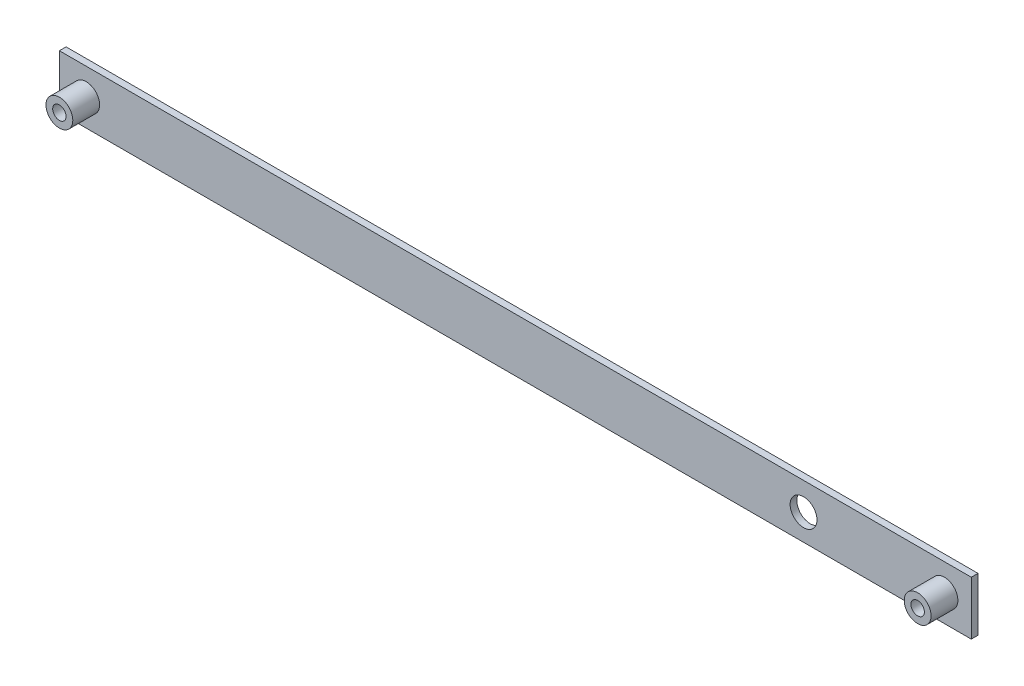
ISO-10303-21;
HEADER;
FILE_DESCRIPTION(('STEP AP214'),'2;1');
FILE_NAME('part.step','',(''),(''),'','','');
FILE_SCHEMA(('AUTOMOTIVE_DESIGN { 1 0 10303 214 1 1 1 1 }'));
ENDSEC;
DATA;
#1=APPLICATION_CONTEXT('core data for automotive mechanical design processes');
#2=APPLICATION_PROTOCOL_DEFINITION('international standard','automotive_design',2000,#1);
#3=PRODUCT_CONTEXT('',#1,'mechanical');
#4=PRODUCT('Part','Part','',(#3));
#5=PRODUCT_RELATED_PRODUCT_CATEGORY('part','',(#4));
#6=PRODUCT_DEFINITION_FORMATION('','',#4);
#7=PRODUCT_DEFINITION_CONTEXT('part definition',#1,'design');
#8=PRODUCT_DEFINITION('design','',#6,#7);
#9=PRODUCT_DEFINITION_SHAPE('','',#8);
#10=(LENGTH_UNIT() NAMED_UNIT(*) SI_UNIT(.MILLI.,.METRE.));
#11=(NAMED_UNIT(*) PLANE_ANGLE_UNIT() SI_UNIT($,.RADIAN.));
#12=(NAMED_UNIT(*) SI_UNIT($,.STERADIAN.) SOLID_ANGLE_UNIT());
#13=UNCERTAINTY_MEASURE_WITH_UNIT(LENGTH_MEASURE(1.E-05),#10,'distance_accuracy_value','');
#14=(GEOMETRIC_REPRESENTATION_CONTEXT(3) GLOBAL_UNCERTAINTY_ASSIGNED_CONTEXT((#13)) GLOBAL_UNIT_ASSIGNED_CONTEXT((#10,
#11,#12)) REPRESENTATION_CONTEXT('',''));
#15=CARTESIAN_POINT('',(0.,0.,0.));
#16=DIRECTION('',(0.,0.,1.));
#17=DIRECTION('',(1.,0.,0.));
#18=AXIS2_PLACEMENT_3D('',#15,#16,#17);
#19=CARTESIAN_POINT('',(0.,0.,3.175));
#20=DIRECTION('',(0.,0.,1.));
#21=DIRECTION('',(1.,0.,0.));
#22=AXIS2_PLACEMENT_3D('',#19,#20,#21);
#23=PLANE('',#22);
#24=CARTESIAN_POINT('',(339.668299959054,-0.33996761182381,3.175));
#25=DIRECTION('',(0.,0.,1.));
#26=DIRECTION('',(1.,0.,0.));
#27=AXIS2_PLACEMENT_3D('',#24,#25,#26);
#28=CIRCLE('',#27,6.35);
#29=CARTESIAN_POINT('',(346.018299959054,-0.33996761182381,3.175));
#30=VERTEX_POINT('',#29);
#31=EDGE_CURVE('E166',#30,#30,#28,.T.);
#32=ORIENTED_EDGE('',*,*,#31,.F.);
#33=EDGE_LOOP('',(#32));
#34=FACE_BOUND('',#33,.T.);
#35=CARTESIAN_POINT('',(0.,0.,3.175));
#36=DIRECTION('',(0.,0.,1.));
#37=DIRECTION('',(1.,0.,0.));
#38=AXIS2_PLACEMENT_3D('',#35,#36,#37);
#39=CIRCLE('',#38,6.35);
#40=CARTESIAN_POINT('',(6.35,0.,3.175));
#41=VERTEX_POINT('',#40);
#42=EDGE_CURVE('E140',#41,#41,#39,.T.);
#43=ORIENTED_EDGE('',*,*,#42,.F.);
#44=EDGE_LOOP('',(#43));
#45=FACE_BOUND('',#44,.T.);
#46=DIRECTION('',(0.,1.,0.));
#47=VECTOR('',#46,1.);
#48=CARTESIAN_POINT('',(419.1,12.7,3.175));
#49=LINE('',#48,#47);
#50=CARTESIAN_POINT('',(419.1,-12.7,3.175));
#51=VERTEX_POINT('',#50);
#52=CARTESIAN_POINT('',(419.1,12.7,3.175));
#53=VERTEX_POINT('',#52);
#54=EDGE_CURVE('E96',#51,#53,#49,.T.);
#55=ORIENTED_EDGE('',*,*,#54,.T.);
#56=DIRECTION('',(-1.,0.,0.));
#57=VECTOR('',#56,1.);
#58=CARTESIAN_POINT('',(-12.7,12.7,3.175));
#59=LINE('',#58,#57);
#60=CARTESIAN_POINT('',(-12.7,12.7,3.175));
#61=VERTEX_POINT('',#60);
#62=EDGE_CURVE('E90',#53,#61,#59,.T.);
#63=ORIENTED_EDGE('',*,*,#62,.T.);
#64=DIRECTION('',(0.,-1.,0.));
#65=VECTOR('',#64,1.);
#66=CARTESIAN_POINT('',(-12.7,12.7,3.175));
#67=LINE('',#66,#65);
#68=CARTESIAN_POINT('',(-12.7,-12.7,3.175));
#69=VERTEX_POINT('',#68);
#70=EDGE_CURVE('E94',#61,#69,#67,.T.);
#71=ORIENTED_EDGE('',*,*,#70,.T.);
#72=DIRECTION('',(1.,0.,0.));
#73=VECTOR('',#72,1.);
#74=CARTESIAN_POINT('',(-12.7,-12.7,3.175));
#75=LINE('',#74,#73);
#76=EDGE_CURVE('E58',#69,#51,#75,.T.);
#77=ORIENTED_EDGE('',*,*,#76,.T.);
#78=EDGE_LOOP('',(#55,#63,#71,#77));
#79=FACE_BOUND('',#78,.T.);
#80=CARTESIAN_POINT('',(406.4,0.,3.175));
#81=DIRECTION('',(0.,0.,1.));
#82=DIRECTION('',(1.,0.,0.));
#83=AXIS2_PLACEMENT_3D('',#80,#81,#82);
#84=CIRCLE('',#83,6.35);
#85=CARTESIAN_POINT('',(412.75,0.,3.175));
#86=VERTEX_POINT('',#85);
#87=EDGE_CURVE('E152',#86,#86,#84,.T.);
#88=ORIENTED_EDGE('',*,*,#87,.F.);
#89=EDGE_LOOP('',(#88));
#90=FACE_BOUND('',#89,.T.);
#91=ADVANCED_FACE('F40',(#34,#45,#79,#90),#23,.T.);
#92=CARTESIAN_POINT('',(0.,0.,0.));
#93=DIRECTION('',(0.,0.,1.));
#94=DIRECTION('',(1.,0.,0.));
#95=AXIS2_PLACEMENT_3D('',#92,#93,#94);
#96=PLANE('',#95);
#97=CARTESIAN_POINT('',(339.668299959054,-0.33996761182381,0.));
#98=DIRECTION('',(0.,0.,1.));
#99=DIRECTION('',(1.,0.,0.));
#100=AXIS2_PLACEMENT_3D('',#97,#98,#99);
#101=CIRCLE('',#100,6.35);
#102=CARTESIAN_POINT('',(346.018299959054,-0.33996761182381,0.));
#103=VERTEX_POINT('',#102);
#104=EDGE_CURVE('E162',#103,#103,#101,.F.);
#105=ORIENTED_EDGE('',*,*,#104,.F.);
#106=EDGE_LOOP('',(#105));
#107=FACE_BOUND('',#106,.T.);
#108=DIRECTION('',(0.,1.,0.));
#109=VECTOR('',#108,1.);
#110=CARTESIAN_POINT('',(419.1,12.7,0.));
#111=LINE('',#110,#109);
#112=CARTESIAN_POINT('',(419.1,-12.7,0.));
#113=VERTEX_POINT('',#112);
#114=CARTESIAN_POINT('',(419.1,12.7,0.));
#115=VERTEX_POINT('',#114);
#116=EDGE_CURVE('E114',#113,#115,#111,.T.);
#117=ORIENTED_EDGE('',*,*,#116,.F.);
#118=DIRECTION('',(1.,0.,0.));
#119=VECTOR('',#118,1.);
#120=CARTESIAN_POINT('',(-12.7,-12.7,0.));
#121=LINE('',#120,#119);
#122=CARTESIAN_POINT('',(-12.7,-12.7,0.));
#123=VERTEX_POINT('',#122);
#124=EDGE_CURVE('E82',#123,#113,#121,.T.);
#125=ORIENTED_EDGE('',*,*,#124,.F.);
#126=DIRECTION('',(0.,-1.,0.));
#127=VECTOR('',#126,1.);
#128=CARTESIAN_POINT('',(-12.7,12.7,0.));
#129=LINE('',#128,#127);
#130=CARTESIAN_POINT('',(-12.7,12.7,0.));
#131=VERTEX_POINT('',#130);
#132=EDGE_CURVE('E76',#131,#123,#129,.T.);
#133=ORIENTED_EDGE('',*,*,#132,.F.);
#134=DIRECTION('',(-1.,0.,0.));
#135=VECTOR('',#134,1.);
#136=CARTESIAN_POINT('',(-12.7,12.7,0.));
#137=LINE('',#136,#135);
#138=EDGE_CURVE('E101',#115,#131,#137,.T.);
#139=ORIENTED_EDGE('',*,*,#138,.F.);
#140=EDGE_LOOP('',(#117,#125,#133,#139));
#141=FACE_BOUND('',#140,.T.);
#142=CARTESIAN_POINT('',(0.,0.,0.));
#143=DIRECTION('',(0.,0.,1.));
#144=DIRECTION('',(1.,0.,0.));
#145=AXIS2_PLACEMENT_3D('',#142,#143,#144);
#146=CIRCLE('',#145,3.175);
#147=CARTESIAN_POINT('',(3.175,0.,0.));
#148=VERTEX_POINT('',#147);
#149=EDGE_CURVE('E117',#148,#148,#146,.T.);
#150=ORIENTED_EDGE('',*,*,#149,.T.);
#151=EDGE_LOOP('',(#150));
#152=FACE_BOUND('',#151,.T.);
#153=CARTESIAN_POINT('',(406.4,0.,0.));
#154=DIRECTION('',(0.,0.,1.));
#155=DIRECTION('',(1.,0.,0.));
#156=AXIS2_PLACEMENT_3D('',#153,#154,#155);
#157=CIRCLE('',#156,3.17499999999997);
#158=CARTESIAN_POINT('',(409.575,0.,0.));
#159=VERTEX_POINT('',#158);
#160=EDGE_CURVE('E135',#159,#159,#157,.T.);
#161=ORIENTED_EDGE('',*,*,#160,.T.);
#162=EDGE_LOOP('',(#161));
#163=FACE_BOUND('',#162,.T.);
#164=ADVANCED_FACE('F127',(#107,#141,#152,#163),#96,.F.);
#165=CARTESIAN_POINT('',(419.1,12.7,3.175));
#166=DIRECTION('',(-1.,0.,0.));
#167=DIRECTION('',(0.,0.,1.));
#168=AXIS2_PLACEMENT_3D('',#165,#166,#167);
#169=PLANE('',#168);
#170=ORIENTED_EDGE('',*,*,#116,.T.);
#171=DIRECTION('',(0.,0.,-1.));
#172=VECTOR('',#171,1.);
#173=CARTESIAN_POINT('',(419.1,12.7,3.175));
#174=LINE('',#173,#172);
#175=EDGE_CURVE('E11',#53,#115,#174,.T.);
#176=ORIENTED_EDGE('',*,*,#175,.F.);
#177=ORIENTED_EDGE('',*,*,#54,.F.);
#178=DIRECTION('',(0.,0.,-1.));
#179=VECTOR('',#178,1.);
#180=CARTESIAN_POINT('',(419.1,-12.7,3.175));
#181=LINE('',#180,#179);
#182=EDGE_CURVE('E110',#51,#113,#181,.T.);
#183=ORIENTED_EDGE('',*,*,#182,.T.);
#184=EDGE_LOOP('',(#170,#176,#177,#183));
#185=FACE_BOUND('',#184,.T.);
#186=ADVANCED_FACE('F42',(#185),#169,.F.);
#187=CARTESIAN_POINT('',(-12.7,12.7,3.175));
#188=DIRECTION('',(0.,-1.,0.));
#189=DIRECTION('',(0.,0.,-1.));
#190=AXIS2_PLACEMENT_3D('',#187,#188,#189);
#191=PLANE('',#190);
#192=ORIENTED_EDGE('',*,*,#138,.T.);
#193=DIRECTION('',(0.,0.,-1.));
#194=VECTOR('',#193,1.);
#195=CARTESIAN_POINT('',(-12.7,12.7,3.175));
#196=LINE('',#195,#194);
#197=EDGE_CURVE('E50',#61,#131,#196,.T.);
#198=ORIENTED_EDGE('',*,*,#197,.F.);
#199=ORIENTED_EDGE('',*,*,#62,.F.);
#200=ORIENTED_EDGE('',*,*,#175,.T.);
#201=EDGE_LOOP('',(#192,#198,#199,#200));
#202=FACE_BOUND('',#201,.T.);
#203=ADVANCED_FACE('F100',(#202),#191,.F.);
#204=CARTESIAN_POINT('',(-12.7,12.7,3.175));
#205=DIRECTION('',(1.,0.,0.));
#206=DIRECTION('',(0.,0.,-1.));
#207=AXIS2_PLACEMENT_3D('',#204,#205,#206);
#208=PLANE('',#207);
#209=ORIENTED_EDGE('',*,*,#132,.T.);
#210=DIRECTION('',(0.,0.,-1.));
#211=VECTOR('',#210,1.);
#212=CARTESIAN_POINT('',(-12.7,-12.7,3.175));
#213=LINE('',#212,#211);
#214=EDGE_CURVE('E103',#69,#123,#213,.T.);
#215=ORIENTED_EDGE('',*,*,#214,.F.);
#216=ORIENTED_EDGE('',*,*,#70,.F.);
#217=ORIENTED_EDGE('',*,*,#197,.T.);
#218=EDGE_LOOP('',(#209,#215,#216,#217));
#219=FACE_BOUND('',#218,.T.);
#220=ADVANCED_FACE('F104',(#219),#208,.F.);
#221=CARTESIAN_POINT('',(-12.7,-12.7,3.175));
#222=DIRECTION('',(0.,1.,0.));
#223=DIRECTION('',(0.,0.,1.));
#224=AXIS2_PLACEMENT_3D('',#221,#222,#223);
#225=PLANE('',#224);
#226=ORIENTED_EDGE('',*,*,#124,.T.);
#227=ORIENTED_EDGE('',*,*,#182,.F.);
#228=ORIENTED_EDGE('',*,*,#76,.F.);
#229=ORIENTED_EDGE('',*,*,#214,.T.);
#230=EDGE_LOOP('',(#226,#227,#228,#229));
#231=FACE_BOUND('',#230,.T.);
#232=ADVANCED_FACE('F124',(#231),#225,.F.);
#233=CARTESIAN_POINT('',(0.,0.,3.175));
#234=DIRECTION('',(0.,0.,-1.));
#235=DIRECTION('',(-1.,0.,0.));
#236=AXIS2_PLACEMENT_3D('',#233,#234,#235);
#237=CYLINDRICAL_SURFACE('',#236,3.175);
#238=ORIENTED_EDGE('',*,*,#149,.F.);
#239=EDGE_LOOP('',(#238));
#240=FACE_BOUND('',#239,.T.);
#241=CARTESIAN_POINT('',(0.,0.,15.875));
#242=DIRECTION('',(0.,0.,1.));
#243=DIRECTION('',(1.,0.,0.));
#244=AXIS2_PLACEMENT_3D('',#241,#242,#243);
#245=CIRCLE('',#244,3.175);
#246=CARTESIAN_POINT('',(3.175,0.,15.875));
#247=VERTEX_POINT('',#246);
#248=EDGE_CURVE('E144',#247,#247,#245,.T.);
#249=ORIENTED_EDGE('',*,*,#248,.T.);
#250=EDGE_LOOP('',(#249));
#251=FACE_BOUND('',#250,.T.);
#252=ADVANCED_FACE('F200',(#240,#251),#237,.F.);
#253=CARTESIAN_POINT('',(406.4,0.,3.175));
#254=DIRECTION('',(0.,0.,-1.));
#255=DIRECTION('',(-1.,0.,0.));
#256=AXIS2_PLACEMENT_3D('',#253,#254,#255);
#257=CYLINDRICAL_SURFACE('',#256,3.17499999999997);
#258=ORIENTED_EDGE('',*,*,#160,.F.);
#259=EDGE_LOOP('',(#258));
#260=FACE_BOUND('',#259,.T.);
#261=CARTESIAN_POINT('',(406.4,0.,15.875));
#262=DIRECTION('',(0.,0.,1.));
#263=DIRECTION('',(1.,0.,0.));
#264=AXIS2_PLACEMENT_3D('',#261,#262,#263);
#265=CIRCLE('',#264,3.17499999999997);
#266=CARTESIAN_POINT('',(409.575,0.,15.875));
#267=VERTEX_POINT('',#266);
#268=EDGE_CURVE('E156',#267,#267,#265,.T.);
#269=ORIENTED_EDGE('',*,*,#268,.T.);
#270=EDGE_LOOP('',(#269));
#271=FACE_BOUND('',#270,.T.);
#272=ADVANCED_FACE('F192',(#260,#271),#257,.F.);
#273=CARTESIAN_POINT('',(0.,0.,15.875));
#274=DIRECTION('',(0.,0.,1.));
#275=DIRECTION('',(1.,0.,0.));
#276=AXIS2_PLACEMENT_3D('',#273,#274,#275);
#277=PLANE('',#276);
#278=CARTESIAN_POINT('',(0.,0.,15.875));
#279=DIRECTION('',(0.,0.,1.));
#280=DIRECTION('',(1.,0.,0.));
#281=AXIS2_PLACEMENT_3D('',#278,#279,#280);
#282=CIRCLE('',#281,6.35);
#283=CARTESIAN_POINT('',(6.35,0.,15.875));
#284=VERTEX_POINT('',#283);
#285=EDGE_CURVE('E139',#284,#284,#282,.T.);
#286=ORIENTED_EDGE('',*,*,#285,.T.);
#287=EDGE_LOOP('',(#286));
#288=FACE_BOUND('',#287,.T.);
#289=ORIENTED_EDGE('',*,*,#248,.F.);
#290=EDGE_LOOP('',(#289));
#291=FACE_BOUND('',#290,.T.);
#292=ADVANCED_FACE('F182',(#288,#291),#277,.T.);
#293=CARTESIAN_POINT('',(0.,0.,15.875));
#294=DIRECTION('',(0.,0.,-1.));
#295=DIRECTION('',(-1.,0.,0.));
#296=AXIS2_PLACEMENT_3D('',#293,#294,#295);
#297=CYLINDRICAL_SURFACE('',#296,6.35);
#298=ORIENTED_EDGE('',*,*,#285,.F.);
#299=EDGE_LOOP('',(#298));
#300=FACE_BOUND('',#299,.T.);
#301=ORIENTED_EDGE('',*,*,#42,.T.);
#302=EDGE_LOOP('',(#301));
#303=FACE_BOUND('',#302,.T.);
#304=ADVANCED_FACE('F179',(#300,#303),#297,.T.);
#305=CARTESIAN_POINT('',(406.4,0.,15.875));
#306=DIRECTION('',(0.,0.,1.));
#307=DIRECTION('',(1.,0.,0.));
#308=AXIS2_PLACEMENT_3D('',#305,#306,#307);
#309=PLANE('',#308);
#310=CARTESIAN_POINT('',(406.4,0.,15.875));
#311=DIRECTION('',(0.,0.,1.));
#312=DIRECTION('',(1.,0.,0.));
#313=AXIS2_PLACEMENT_3D('',#310,#311,#312);
#314=CIRCLE('',#313,6.35);
#315=CARTESIAN_POINT('',(412.75,0.,15.875));
#316=VERTEX_POINT('',#315);
#317=EDGE_CURVE('E151',#316,#316,#314,.T.);
#318=ORIENTED_EDGE('',*,*,#317,.T.);
#319=EDGE_LOOP('',(#318));
#320=FACE_BOUND('',#319,.T.);
#321=ORIENTED_EDGE('',*,*,#268,.F.);
#322=EDGE_LOOP('',(#321));
#323=FACE_BOUND('',#322,.T.);
#324=ADVANCED_FACE('F181',(#320,#323),#309,.T.);
#325=CARTESIAN_POINT('',(406.4,0.,15.875));
#326=DIRECTION('',(0.,0.,-1.));
#327=DIRECTION('',(-1.,0.,0.));
#328=AXIS2_PLACEMENT_3D('',#325,#326,#327);
#329=CYLINDRICAL_SURFACE('',#328,6.35);
#330=ORIENTED_EDGE('',*,*,#317,.F.);
#331=EDGE_LOOP('',(#330));
#332=FACE_BOUND('',#331,.T.);
#333=ORIENTED_EDGE('',*,*,#87,.T.);
#334=EDGE_LOOP('',(#333));
#335=FACE_BOUND('',#334,.T.);
#336=ADVANCED_FACE('F189',(#332,#335),#329,.T.);
#337=CARTESIAN_POINT('',(339.668299959054,-0.33996761182381,-0.00100000000000013));
#338=DIRECTION('',(0.,0.,1.));
#339=DIRECTION('',(1.,0.,0.));
#340=AXIS2_PLACEMENT_3D('',#337,#338,#339);
#341=CYLINDRICAL_SURFACE('',#340,6.35);
#342=ORIENTED_EDGE('',*,*,#31,.T.);
#343=EDGE_LOOP('',(#342));
#344=FACE_BOUND('',#343,.T.);
#345=ORIENTED_EDGE('',*,*,#104,.T.);
#346=EDGE_LOOP('',(#345));
#347=FACE_BOUND('',#346,.T.);
#348=ADVANCED_FACE('F171',(#344,#347),#341,.F.);
#349=CLOSED_SHELL('',(#91,#164,#186,#203,#220,#232,#252,#272,#292,#304,#324,#336,#348));
#350=MANIFOLD_SOLID_BREP('B2',#349);
#351=ADVANCED_BREP_SHAPE_REPRESENTATION('',(#18,#350),#14);
#352=SHAPE_DEFINITION_REPRESENTATION(#9,#351);
ENDSEC;
END-ISO-10303-21;
